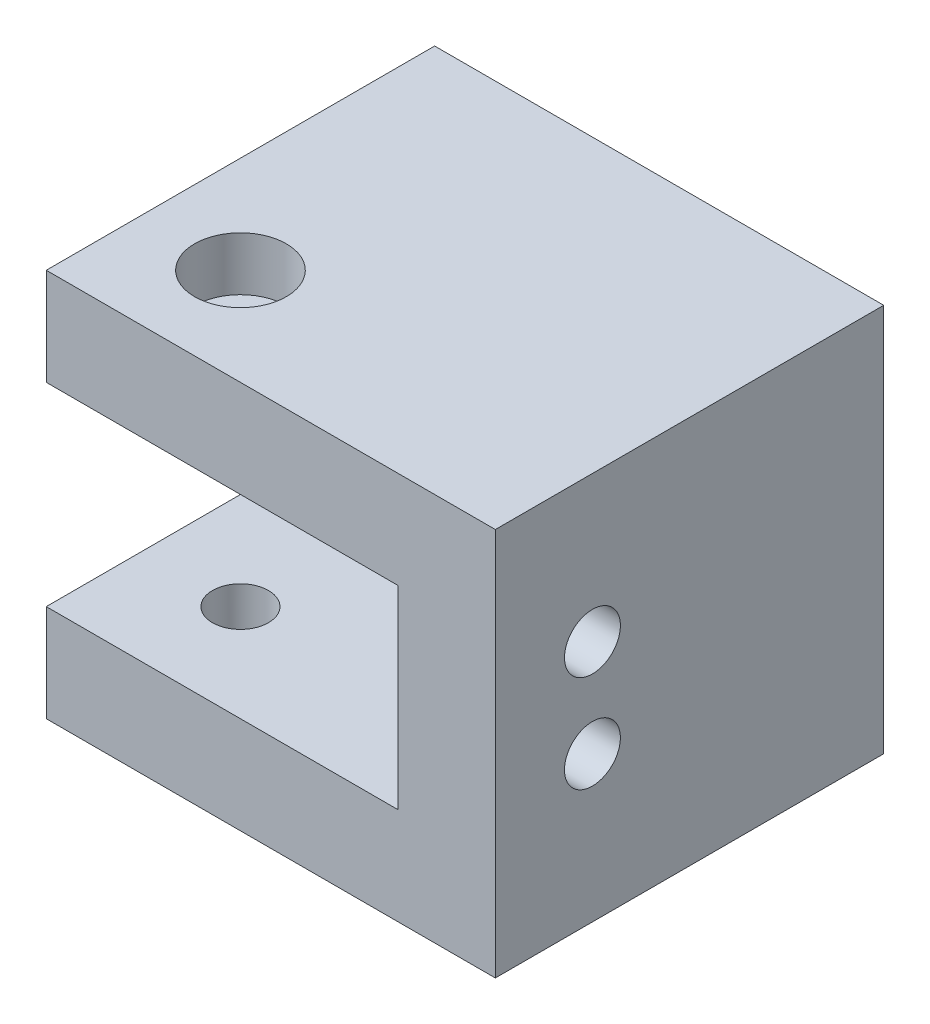
ISO-10303-21;
HEADER;
FILE_DESCRIPTION(('STEP AP214'),'2;1');
FILE_NAME('part.step','',(''),(''),'','','');
FILE_SCHEMA(('AUTOMOTIVE_DESIGN { 1 0 10303 214 1 1 1 1 }'));
ENDSEC;
DATA;
#1=APPLICATION_CONTEXT('core data for automotive mechanical design processes');
#2=APPLICATION_PROTOCOL_DEFINITION('international standard','automotive_design',2000,#1);
#3=PRODUCT_CONTEXT('',#1,'mechanical');
#4=PRODUCT('Part','Part','',(#3));
#5=PRODUCT_RELATED_PRODUCT_CATEGORY('part','',(#4));
#6=PRODUCT_DEFINITION_FORMATION('','',#4);
#7=PRODUCT_DEFINITION_CONTEXT('part definition',#1,'design');
#8=PRODUCT_DEFINITION('design','',#6,#7);
#9=PRODUCT_DEFINITION_SHAPE('','',#8);
#10=(LENGTH_UNIT() NAMED_UNIT(*) SI_UNIT(.MILLI.,.METRE.));
#11=(NAMED_UNIT(*) PLANE_ANGLE_UNIT() SI_UNIT($,.RADIAN.));
#12=(NAMED_UNIT(*) SI_UNIT($,.STERADIAN.) SOLID_ANGLE_UNIT());
#13=UNCERTAINTY_MEASURE_WITH_UNIT(LENGTH_MEASURE(1.E-05),#10,'distance_accuracy_value','');
#14=(GEOMETRIC_REPRESENTATION_CONTEXT(3) GLOBAL_UNCERTAINTY_ASSIGNED_CONTEXT((#13)) GLOBAL_UNIT_ASSIGNED_CONTEXT((#10,
#11,#12)) REPRESENTATION_CONTEXT('',''));
#15=CARTESIAN_POINT('',(0.,0.,0.));
#16=DIRECTION('',(0.,0.,1.));
#17=DIRECTION('',(1.,0.,0.));
#18=AXIS2_PLACEMENT_3D('',#15,#16,#17);
#19=CARTESIAN_POINT('',(0.,0.,25.4));
#20=DIRECTION('',(1.,0.,0.));
#21=DIRECTION('',(0.,1.,0.));
#22=AXIS2_PLACEMENT_3D('',#19,#20,#21);
#23=PLANE('',#22);
#24=DIRECTION('',(0.,-1.,0.));
#25=VECTOR('',#24,1.);
#26=CARTESIAN_POINT('',(0.,19.05,9.525));
#27=LINE('',#26,#25);
#28=CARTESIAN_POINT('',(0.,15.875,9.525));
#29=VERTEX_POINT('',#28);
#30=CARTESIAN_POINT('',(0.,9.525,9.525));
#31=VERTEX_POINT('',#30);
#32=EDGE_CURVE('E185',#29,#31,#27,.T.);
#33=ORIENTED_EDGE('',*,*,#32,.F.);
#34=CARTESIAN_POINT('',(0.,15.875,12.7));
#35=DIRECTION('',(1.,0.,0.));
#36=DIRECTION('',(0.,1.,0.));
#37=AXIS2_PLACEMENT_3D('',#34,#35,#36);
#38=CIRCLE('',#37,3.175);
#39=CARTESIAN_POINT('',(0.,19.05,12.7));
#40=VERTEX_POINT('',#39);
#41=EDGE_CURVE('E12',#29,#40,#38,.T.);
#42=ORIENTED_EDGE('',*,*,#41,.T.);
#43=DIRECTION('',(0.,0.,1.));
#44=VECTOR('',#43,1.);
#45=CARTESIAN_POINT('',(0.,19.05,9.525));
#46=LINE('',#45,#44);
#47=CARTESIAN_POINT('',(0.,19.05,25.4));
#48=VERTEX_POINT('',#47);
#49=EDGE_CURVE('E189',#40,#48,#46,.T.);
#50=ORIENTED_EDGE('',*,*,#49,.T.);
#51=DIRECTION('',(0.,-1.,0.));
#52=VECTOR('',#51,1.);
#53=CARTESIAN_POINT('',(0.,0.,25.4));
#54=LINE('',#53,#52);
#55=CARTESIAN_POINT('',(0.,25.4,25.4));
#56=VERTEX_POINT('',#55);
#57=EDGE_CURVE('E195',#56,#48,#54,.T.);
#58=ORIENTED_EDGE('',*,*,#57,.F.);
#59=DIRECTION('',(0.,0.,-1.));
#60=VECTOR('',#59,1.);
#61=CARTESIAN_POINT('',(0.,25.4,25.4));
#62=LINE('',#61,#60);
#63=CARTESIAN_POINT('',(0.,25.4,0.));
#64=VERTEX_POINT('',#63);
#65=EDGE_CURVE('E204',#56,#64,#62,.T.);
#66=ORIENTED_EDGE('',*,*,#65,.T.);
#67=DIRECTION('',(0.,-1.,0.));
#68=VECTOR('',#67,1.);
#69=CARTESIAN_POINT('',(0.,0.,0.));
#70=LINE('',#69,#68);
#71=CARTESIAN_POINT('',(0.,0.,0.));
#72=VERTEX_POINT('',#71);
#73=EDGE_CURVE('E191',#64,#72,#70,.T.);
#74=ORIENTED_EDGE('',*,*,#73,.T.);
#75=DIRECTION('',(0.,0.,-1.));
#76=VECTOR('',#75,1.);
#77=CARTESIAN_POINT('',(0.,0.,25.4));
#78=LINE('',#77,#76);
#79=CARTESIAN_POINT('',(0.,0.,25.4));
#80=VERTEX_POINT('',#79);
#81=EDGE_CURVE('E221',#80,#72,#78,.T.);
#82=ORIENTED_EDGE('',*,*,#81,.F.);
#83=CARTESIAN_POINT('',(0.,6.35,25.4));
#84=VERTEX_POINT('',#83);
#85=EDGE_CURVE('E198',#84,#80,#54,.T.);
#86=ORIENTED_EDGE('',*,*,#85,.F.);
#87=DIRECTION('',(0.,0.,1.));
#88=VECTOR('',#87,1.);
#89=CARTESIAN_POINT('',(0.,6.35,9.525));
#90=LINE('',#89,#88);
#91=CARTESIAN_POINT('',(0.,6.35,12.7));
#92=VERTEX_POINT('',#91);
#93=EDGE_CURVE('E171',#92,#84,#90,.T.);
#94=ORIENTED_EDGE('',*,*,#93,.F.);
#95=CARTESIAN_POINT('',(0.,9.525,12.7));
#96=DIRECTION('',(1.,0.,0.));
#97=DIRECTION('',(0.,1.,0.));
#98=AXIS2_PLACEMENT_3D('',#95,#96,#97);
#99=CIRCLE('',#98,3.175);
#100=EDGE_CURVE('E94',#92,#31,#99,.T.);
#101=ORIENTED_EDGE('',*,*,#100,.T.);
#102=EDGE_LOOP('',(#33,#42,#50,#58,#66,#74,#82,#86,#94,#101));
#103=FACE_BOUND('',#102,.T.);
#104=ADVANCED_FACE('F86',(#103),#23,.F.);
#105=CARTESIAN_POINT('',(0.,0.,25.4));
#106=DIRECTION('',(0.,1.,0.));
#107=DIRECTION('',(0.,0.,1.));
#108=AXIS2_PLACEMENT_3D('',#105,#106,#107);
#109=PLANE('',#108);
#110=CARTESIAN_POINT('',(6.35,0.,19.05));
#111=DIRECTION('',(0.,1.,0.));
#112=DIRECTION('',(0.,0.,1.));
#113=AXIS2_PLACEMENT_3D('',#110,#111,#112);
#114=CIRCLE('',#113,1.82879999999999);
#115=CARTESIAN_POINT('',(6.35,0.,20.8788));
#116=VERTEX_POINT('',#115);
#117=EDGE_CURVE('E228',#116,#116,#114,.T.);
#118=ORIENTED_EDGE('',*,*,#117,.T.);
#119=EDGE_LOOP('',(#118));
#120=FACE_BOUND('',#119,.T.);
#121=DIRECTION('',(1.,0.,0.));
#122=VECTOR('',#121,1.);
#123=CARTESIAN_POINT('',(0.,0.,0.));
#124=LINE('',#123,#122);
#125=CARTESIAN_POINT('',(29.36875,0.,0.));
#126=VERTEX_POINT('',#125);
#127=EDGE_CURVE('E207',#72,#126,#124,.T.);
#128=ORIENTED_EDGE('',*,*,#127,.T.);
#129=DIRECTION('',(0.,0.,-1.));
#130=VECTOR('',#129,1.);
#131=CARTESIAN_POINT('',(29.36875,0.,25.4));
#132=LINE('',#131,#130);
#133=CARTESIAN_POINT('',(29.36875,0.,25.4));
#134=VERTEX_POINT('',#133);
#135=EDGE_CURVE('E218',#134,#126,#132,.T.);
#136=ORIENTED_EDGE('',*,*,#135,.F.);
#137=DIRECTION('',(1.,0.,0.));
#138=VECTOR('',#137,1.);
#139=CARTESIAN_POINT('',(0.,0.,25.4));
#140=LINE('',#139,#138);
#141=EDGE_CURVE('E197',#80,#134,#140,.T.);
#142=ORIENTED_EDGE('',*,*,#141,.F.);
#143=ORIENTED_EDGE('',*,*,#81,.T.);
#144=EDGE_LOOP('',(#128,#136,#142,#143));
#145=FACE_BOUND('',#144,.T.);
#146=ADVANCED_FACE('F271',(#120,#145),#109,.F.);
#147=CARTESIAN_POINT('',(29.36875,0.,25.4));
#148=DIRECTION('',(-1.,0.,0.));
#149=DIRECTION('',(0.,-1.,0.));
#150=AXIS2_PLACEMENT_3D('',#147,#148,#149);
#151=PLANE('',#150);
#152=CARTESIAN_POINT('',(29.36875,15.875,19.05));
#153=DIRECTION('',(1.,0.,0.));
#154=DIRECTION('',(0.,0.,-1.));
#155=AXIS2_PLACEMENT_3D('',#152,#153,#154);
#156=CIRCLE('',#155,1.8288);
#157=CARTESIAN_POINT('',(29.36875,15.875,17.2212));
#158=VERTEX_POINT('',#157);
#159=EDGE_CURVE('E237',#158,#158,#156,.T.);
#160=ORIENTED_EDGE('',*,*,#159,.F.);
#161=EDGE_LOOP('',(#160));
#162=FACE_BOUND('',#161,.T.);
#163=CARTESIAN_POINT('',(29.36875,9.525,19.05));
#164=DIRECTION('',(1.,0.,0.));
#165=DIRECTION('',(0.,0.,-1.));
#166=AXIS2_PLACEMENT_3D('',#163,#164,#165);
#167=CIRCLE('',#166,1.8288);
#168=CARTESIAN_POINT('',(29.36875,9.525,17.2212));
#169=VERTEX_POINT('',#168);
#170=EDGE_CURVE('E233',#169,#169,#167,.T.);
#171=ORIENTED_EDGE('',*,*,#170,.F.);
#172=EDGE_LOOP('',(#171));
#173=FACE_BOUND('',#172,.T.);
#174=DIRECTION('',(0.,1.,0.));
#175=VECTOR('',#174,1.);
#176=CARTESIAN_POINT('',(29.36875,0.,0.));
#177=LINE('',#176,#175);
#178=CARTESIAN_POINT('',(29.36875,25.4,0.));
#179=VERTEX_POINT('',#178);
#180=EDGE_CURVE('E209',#126,#179,#177,.T.);
#181=ORIENTED_EDGE('',*,*,#180,.T.);
#182=DIRECTION('',(0.,0.,-1.));
#183=VECTOR('',#182,1.);
#184=CARTESIAN_POINT('',(29.36875,25.4,25.4));
#185=LINE('',#184,#183);
#186=CARTESIAN_POINT('',(29.36875,25.4,25.4));
#187=VERTEX_POINT('',#186);
#188=EDGE_CURVE('E215',#187,#179,#185,.T.);
#189=ORIENTED_EDGE('',*,*,#188,.F.);
#190=DIRECTION('',(0.,1.,0.));
#191=VECTOR('',#190,1.);
#192=CARTESIAN_POINT('',(29.36875,0.,25.4));
#193=LINE('',#192,#191);
#194=EDGE_CURVE('E200',#134,#187,#193,.T.);
#195=ORIENTED_EDGE('',*,*,#194,.F.);
#196=ORIENTED_EDGE('',*,*,#135,.T.);
#197=EDGE_LOOP('',(#181,#189,#195,#196));
#198=FACE_BOUND('',#197,.T.);
#199=ADVANCED_FACE('F275',(#162,#173,#198),#151,.F.);
#200=CARTESIAN_POINT('',(0.,25.4,25.4));
#201=DIRECTION('',(0.,-1.,0.));
#202=DIRECTION('',(0.,0.,-1.));
#203=AXIS2_PLACEMENT_3D('',#200,#201,#202);
#204=PLANE('',#203);
#205=CARTESIAN_POINT('',(6.35,25.4,19.05));
#206=DIRECTION('',(0.,1.,0.));
#207=DIRECTION('',(0.,0.,1.));
#208=AXIS2_PLACEMENT_3D('',#205,#206,#207);
#209=CIRCLE('',#208,2.999999969);
#210=CARTESIAN_POINT('',(6.35,25.4,22.049999969));
#211=VERTEX_POINT('',#210);
#212=EDGE_CURVE('E232',#211,#211,#209,.T.);
#213=ORIENTED_EDGE('',*,*,#212,.F.);
#214=EDGE_LOOP('',(#213));
#215=FACE_BOUND('',#214,.T.);
#216=DIRECTION('',(-1.,0.,0.));
#217=VECTOR('',#216,1.);
#218=CARTESIAN_POINT('',(0.,25.4,0.));
#219=LINE('',#218,#217);
#220=EDGE_CURVE('E211',#179,#64,#219,.T.);
#221=ORIENTED_EDGE('',*,*,#220,.T.);
#222=ORIENTED_EDGE('',*,*,#65,.F.);
#223=DIRECTION('',(-1.,0.,0.));
#224=VECTOR('',#223,1.);
#225=CARTESIAN_POINT('',(0.,25.4,25.4));
#226=LINE('',#225,#224);
#227=EDGE_CURVE('E202',#187,#56,#226,.T.);
#228=ORIENTED_EDGE('',*,*,#227,.F.);
#229=ORIENTED_EDGE('',*,*,#188,.T.);
#230=EDGE_LOOP('',(#221,#222,#228,#229));
#231=FACE_BOUND('',#230,.T.);
#232=ADVANCED_FACE('F281',(#215,#231),#204,.F.);
#233=CARTESIAN_POINT('',(0.,0.,25.4));
#234=DIRECTION('',(0.,0.,-1.));
#235=DIRECTION('',(-1.,0.,0.));
#236=AXIS2_PLACEMENT_3D('',#233,#234,#235);
#237=PLANE('',#236);
#238=ORIENTED_EDGE('',*,*,#57,.T.);
#239=DIRECTION('',(-1.,0.,0.));
#240=VECTOR('',#239,1.);
#241=CARTESIAN_POINT('',(0.,19.05,25.4));
#242=LINE('',#241,#240);
#243=CARTESIAN_POINT('',(23.01875,19.05,25.4));
#244=VERTEX_POINT('',#243);
#245=EDGE_CURVE('E183',#244,#48,#242,.T.);
#246=ORIENTED_EDGE('',*,*,#245,.F.);
#247=DIRECTION('',(0.,1.,0.));
#248=VECTOR('',#247,1.);
#249=CARTESIAN_POINT('',(23.01875,19.05,25.4));
#250=LINE('',#249,#248);
#251=CARTESIAN_POINT('',(23.01875,6.35,25.4));
#252=VERTEX_POINT('',#251);
#253=EDGE_CURVE('E167',#252,#244,#250,.T.);
#254=ORIENTED_EDGE('',*,*,#253,.F.);
#255=DIRECTION('',(1.,0.,0.));
#256=VECTOR('',#255,1.);
#257=CARTESIAN_POINT('',(0.,6.35,25.4));
#258=LINE('',#257,#256);
#259=EDGE_CURVE('E174',#84,#252,#258,.T.);
#260=ORIENTED_EDGE('',*,*,#259,.F.);
#261=ORIENTED_EDGE('',*,*,#85,.T.);
#262=ORIENTED_EDGE('',*,*,#141,.T.);
#263=ORIENTED_EDGE('',*,*,#194,.T.);
#264=ORIENTED_EDGE('',*,*,#227,.T.);
#265=EDGE_LOOP('',(#238,#246,#254,#260,#261,#262,#263,#264));
#266=FACE_BOUND('',#265,.T.);
#267=ADVANCED_FACE('F181',(#266),#237,.F.);
#268=CARTESIAN_POINT('',(0.,0.,0.));
#269=DIRECTION('',(0.,0.,-1.));
#270=DIRECTION('',(-1.,0.,0.));
#271=AXIS2_PLACEMENT_3D('',#268,#269,#270);
#272=PLANE('',#271);
#273=CARTESIAN_POINT('',(6.35,12.7,0.));
#274=DIRECTION('',(0.,0.,1.));
#275=DIRECTION('',(1.,0.,0.));
#276=AXIS2_PLACEMENT_3D('',#273,#274,#275);
#277=CIRCLE('',#276,2.5527);
#278=CARTESIAN_POINT('',(8.9027,12.7,0.));
#279=VERTEX_POINT('',#278);
#280=EDGE_CURVE('E332',#279,#279,#277,.T.);
#281=ORIENTED_EDGE('',*,*,#280,.T.);
#282=EDGE_LOOP('',(#281));
#283=FACE_BOUND('',#282,.T.);
#284=CARTESIAN_POINT('',(17.78,12.7,0.));
#285=DIRECTION('',(0.,0.,1.));
#286=DIRECTION('',(1.,0.,0.));
#287=AXIS2_PLACEMENT_3D('',#284,#285,#286);
#288=CIRCLE('',#287,2.5527);
#289=CARTESIAN_POINT('',(20.3327,12.7,0.));
#290=VERTEX_POINT('',#289);
#291=EDGE_CURVE('E342',#290,#290,#288,.T.);
#292=ORIENTED_EDGE('',*,*,#291,.T.);
#293=EDGE_LOOP('',(#292));
#294=FACE_BOUND('',#293,.T.);
#295=ORIENTED_EDGE('',*,*,#73,.F.);
#296=ORIENTED_EDGE('',*,*,#220,.F.);
#297=ORIENTED_EDGE('',*,*,#180,.F.);
#298=ORIENTED_EDGE('',*,*,#127,.F.);
#299=EDGE_LOOP('',(#295,#296,#297,#298));
#300=FACE_BOUND('',#299,.T.);
#301=ADVANCED_FACE('F286',(#283,#294,#300),#272,.T.);
#302=CARTESIAN_POINT('',(0.,19.05,9.525));
#303=DIRECTION('',(0.,1.,0.));
#304=DIRECTION('',(0.,0.,1.));
#305=AXIS2_PLACEMENT_3D('',#302,#303,#304);
#306=PLANE('',#305);
#307=CARTESIAN_POINT('',(6.35,19.05,19.05));
#308=DIRECTION('',(0.,1.,0.));
#309=DIRECTION('',(0.,0.,1.));
#310=AXIS2_PLACEMENT_3D('',#307,#308,#309);
#311=CIRCLE('',#310,1.8288);
#312=CARTESIAN_POINT('',(6.35,19.05,20.8788));
#313=VERTEX_POINT('',#312);
#314=EDGE_CURVE('E178',#313,#313,#311,.T.);
#315=ORIENTED_EDGE('',*,*,#314,.T.);
#316=EDGE_LOOP('',(#315));
#317=FACE_BOUND('',#316,.T.);
#318=ORIENTED_EDGE('',*,*,#49,.F.);
#319=DIRECTION('',(-1.,0.,0.));
#320=VECTOR('',#319,1.);
#321=CARTESIAN_POINT('',(0.,19.05,12.7));
#322=LINE('',#321,#320);
#323=CARTESIAN_POINT('',(23.01875,19.05,12.7));
#324=VERTEX_POINT('',#323);
#325=EDGE_CURVE('E247',#40,#324,#322,.F.);
#326=ORIENTED_EDGE('',*,*,#325,.T.);
#327=DIRECTION('',(0.,0.,1.));
#328=VECTOR('',#327,1.);
#329=CARTESIAN_POINT('',(23.01875,19.05,9.525));
#330=LINE('',#329,#328);
#331=EDGE_CURVE('E170',#324,#244,#330,.T.);
#332=ORIENTED_EDGE('',*,*,#331,.T.);
#333=ORIENTED_EDGE('',*,*,#245,.T.);
#334=EDGE_LOOP('',(#318,#326,#332,#333));
#335=FACE_BOUND('',#334,.T.);
#336=ADVANCED_FACE('F289',(#317,#335),#306,.F.);
#337=CARTESIAN_POINT('',(23.01875,19.05,9.525));
#338=DIRECTION('',(1.,0.,0.));
#339=DIRECTION('',(0.,1.,0.));
#340=AXIS2_PLACEMENT_3D('',#337,#338,#339);
#341=PLANE('',#340);
#342=CARTESIAN_POINT('',(23.01875,15.875,19.05));
#343=DIRECTION('',(1.,0.,0.));
#344=DIRECTION('',(0.,1.,0.));
#345=AXIS2_PLACEMENT_3D('',#342,#343,#344);
#346=CIRCLE('',#345,1.82879999999999);
#347=CARTESIAN_POINT('',(23.01875,17.7038,19.05));
#348=VERTEX_POINT('',#347);
#349=EDGE_CURVE('E234',#348,#348,#346,.T.);
#350=ORIENTED_EDGE('',*,*,#349,.T.);
#351=EDGE_LOOP('',(#350));
#352=FACE_BOUND('',#351,.T.);
#353=CARTESIAN_POINT('',(23.01875,9.525,19.05));
#354=DIRECTION('',(1.,0.,0.));
#355=DIRECTION('',(0.,1.,0.));
#356=AXIS2_PLACEMENT_3D('',#353,#354,#355);
#357=CIRCLE('',#356,1.8288);
#358=CARTESIAN_POINT('',(23.01875,11.3538,19.05));
#359=VERTEX_POINT('',#358);
#360=EDGE_CURVE('E229',#359,#359,#357,.T.);
#361=ORIENTED_EDGE('',*,*,#360,.T.);
#362=EDGE_LOOP('',(#361));
#363=FACE_BOUND('',#362,.T.);
#364=DIRECTION('',(0.,1.,0.));
#365=VECTOR('',#364,1.);
#366=CARTESIAN_POINT('',(23.01875,19.05,9.525));
#367=LINE('',#366,#365);
#368=CARTESIAN_POINT('',(23.01875,9.525,9.525));
#369=VERTEX_POINT('',#368);
#370=CARTESIAN_POINT('',(23.01875,15.875,9.525));
#371=VERTEX_POINT('',#370);
#372=EDGE_CURVE('E194',#369,#371,#367,.T.);
#373=ORIENTED_EDGE('',*,*,#372,.F.);
#374=CARTESIAN_POINT('',(23.01875,9.525,12.7));
#375=DIRECTION('',(1.,0.,0.));
#376=DIRECTION('',(0.,1.,0.));
#377=AXIS2_PLACEMENT_3D('',#374,#375,#376);
#378=CIRCLE('',#377,3.175);
#379=CARTESIAN_POINT('',(23.01875,6.35,12.7));
#380=VERTEX_POINT('',#379);
#381=EDGE_CURVE('E169',#369,#380,#378,.F.);
#382=ORIENTED_EDGE('',*,*,#381,.T.);
#383=DIRECTION('',(0.,0.,1.));
#384=VECTOR('',#383,1.);
#385=CARTESIAN_POINT('',(23.01875,6.35,9.525));
#386=LINE('',#385,#384);
#387=EDGE_CURVE('E161',#380,#252,#386,.T.);
#388=ORIENTED_EDGE('',*,*,#387,.T.);
#389=ORIENTED_EDGE('',*,*,#253,.T.);
#390=ORIENTED_EDGE('',*,*,#331,.F.);
#391=CARTESIAN_POINT('',(23.01875,15.875,12.7));
#392=DIRECTION('',(1.,0.,0.));
#393=DIRECTION('',(0.,1.,0.));
#394=AXIS2_PLACEMENT_3D('',#391,#392,#393);
#395=CIRCLE('',#394,3.175);
#396=EDGE_CURVE('E243',#324,#371,#395,.F.);
#397=ORIENTED_EDGE('',*,*,#396,.T.);
#398=EDGE_LOOP('',(#373,#382,#388,#389,#390,#397));
#399=FACE_BOUND('',#398,.T.);
#400=ADVANCED_FACE('F164',(#352,#363,#399),#341,.F.);
#401=CARTESIAN_POINT('',(0.,6.35,9.525));
#402=DIRECTION('',(0.,-1.,0.));
#403=DIRECTION('',(0.,0.,-1.));
#404=AXIS2_PLACEMENT_3D('',#401,#402,#403);
#405=PLANE('',#404);
#406=CARTESIAN_POINT('',(6.35,6.35,19.05));
#407=DIRECTION('',(0.,-1.,0.));
#408=DIRECTION('',(0.,0.,-1.));
#409=AXIS2_PLACEMENT_3D('',#406,#407,#408);
#410=CIRCLE('',#409,1.8288);
#411=CARTESIAN_POINT('',(6.35,6.35,17.2212));
#412=VERTEX_POINT('',#411);
#413=EDGE_CURVE('E225',#412,#412,#410,.T.);
#414=ORIENTED_EDGE('',*,*,#413,.T.);
#415=EDGE_LOOP('',(#414));
#416=FACE_BOUND('',#415,.T.);
#417=ORIENTED_EDGE('',*,*,#387,.F.);
#418=DIRECTION('',(1.,0.,0.));
#419=VECTOR('',#418,1.);
#420=CARTESIAN_POINT('',(0.,6.35,12.7));
#421=LINE('',#420,#419);
#422=EDGE_CURVE('E107',#380,#92,#421,.F.);
#423=ORIENTED_EDGE('',*,*,#422,.T.);
#424=ORIENTED_EDGE('',*,*,#93,.T.);
#425=ORIENTED_EDGE('',*,*,#259,.T.);
#426=EDGE_LOOP('',(#417,#423,#424,#425));
#427=FACE_BOUND('',#426,.T.);
#428=ADVANCED_FACE('F175',(#416,#427),#405,.F.);
#429=CARTESIAN_POINT('',(0.,0.,9.525));
#430=DIRECTION('',(0.,0.,1.));
#431=DIRECTION('',(1.,0.,0.));
#432=AXIS2_PLACEMENT_3D('',#429,#430,#431);
#433=PLANE('',#432);
#434=CARTESIAN_POINT('',(6.35,12.7,9.525));
#435=DIRECTION('',(0.,0.,1.));
#436=DIRECTION('',(1.,0.,0.));
#437=AXIS2_PLACEMENT_3D('',#434,#435,#436);
#438=CIRCLE('',#437,2.5527);
#439=CARTESIAN_POINT('',(8.9027,12.7,9.525));
#440=VERTEX_POINT('',#439);
#441=EDGE_CURVE('E335',#440,#440,#438,.T.);
#442=ORIENTED_EDGE('',*,*,#441,.F.);
#443=EDGE_LOOP('',(#442));
#444=FACE_BOUND('',#443,.T.);
#445=CARTESIAN_POINT('',(17.78,12.7,9.525));
#446=DIRECTION('',(0.,0.,1.));
#447=DIRECTION('',(1.,0.,0.));
#448=AXIS2_PLACEMENT_3D('',#445,#446,#447);
#449=CIRCLE('',#448,2.5527);
#450=CARTESIAN_POINT('',(20.3327,12.7,9.525));
#451=VERTEX_POINT('',#450);
#452=EDGE_CURVE('E337',#451,#451,#449,.T.);
#453=ORIENTED_EDGE('',*,*,#452,.F.);
#454=EDGE_LOOP('',(#453));
#455=FACE_BOUND('',#454,.T.);
#456=ORIENTED_EDGE('',*,*,#32,.T.);
#457=DIRECTION('',(1.,0.,0.));
#458=VECTOR('',#457,1.);
#459=CARTESIAN_POINT('',(0.,9.525,9.525));
#460=LINE('',#459,#458);
#461=EDGE_CURVE('E240',#31,#369,#460,.T.);
#462=ORIENTED_EDGE('',*,*,#461,.T.);
#463=ORIENTED_EDGE('',*,*,#372,.T.);
#464=DIRECTION('',(-1.,0.,0.));
#465=VECTOR('',#464,1.);
#466=CARTESIAN_POINT('',(0.,15.875,9.525));
#467=LINE('',#466,#465);
#468=EDGE_CURVE('E224',#371,#29,#467,.T.);
#469=ORIENTED_EDGE('',*,*,#468,.T.);
#470=EDGE_LOOP('',(#456,#462,#463,#469));
#471=FACE_BOUND('',#470,.T.);
#472=ADVANCED_FACE('F253',(#444,#455,#471),#433,.T.);
#473=CARTESIAN_POINT('',(6.35,25.4,19.05));
#474=DIRECTION('',(0.,1.,0.));
#475=DIRECTION('',(0.,0.,1.));
#476=AXIS2_PLACEMENT_3D('',#473,#474,#475);
#477=CYLINDRICAL_SURFACE('',#476,1.8288);
#478=ORIENTED_EDGE('',*,*,#117,.F.);
#479=EDGE_LOOP('',(#478));
#480=FACE_BOUND('',#479,.T.);
#481=ORIENTED_EDGE('',*,*,#413,.F.);
#482=EDGE_LOOP('',(#481));
#483=FACE_BOUND('',#482,.T.);
#484=ADVANCED_FACE('F304',(#480,#483),#477,.F.);
#485=CARTESIAN_POINT('',(6.35,21.8948,19.05));
#486=DIRECTION('',(0.,1.,0.));
#487=DIRECTION('',(0.,0.,1.));
#488=AXIS2_PLACEMENT_3D('',#485,#486,#487);
#489=CIRCLE('',#488,1.8288);
#490=CARTESIAN_POINT('',(6.35,21.8948,20.8788));
#491=VERTEX_POINT('',#490);
#492=EDGE_CURVE('E354',#491,#491,#489,.T.);
#493=ORIENTED_EDGE('',*,*,#492,.T.);
#494=EDGE_LOOP('',(#493));
#495=FACE_BOUND('',#494,.T.);
#496=ORIENTED_EDGE('',*,*,#314,.F.);
#497=EDGE_LOOP('',(#496));
#498=FACE_BOUND('',#497,.T.);
#499=ADVANCED_FACE('F306',(#495,#498),#477,.F.);
#500=CARTESIAN_POINT('',(8.1788,21.8948,19.05));
#501=DIRECTION('',(0.,-1.,0.));
#502=DIRECTION('',(0.,0.,-1.));
#503=AXIS2_PLACEMENT_3D('',#500,#501,#502);
#504=PLANE('',#503);
#505=ORIENTED_EDGE('',*,*,#492,.F.);
#506=EDGE_LOOP('',(#505));
#507=FACE_BOUND('',#506,.T.);
#508=CARTESIAN_POINT('',(6.35,21.8948,19.05));
#509=DIRECTION('',(0.,1.,0.));
#510=DIRECTION('',(0.,0.,1.));
#511=AXIS2_PLACEMENT_3D('',#508,#509,#510);
#512=CIRCLE('',#511,2.999999969);
#513=CARTESIAN_POINT('',(6.35,21.8948,22.049999969));
#514=VERTEX_POINT('',#513);
#515=EDGE_CURVE('E351',#514,#514,#512,.T.);
#516=ORIENTED_EDGE('',*,*,#515,.T.);
#517=EDGE_LOOP('',(#516));
#518=FACE_BOUND('',#517,.T.);
#519=ADVANCED_FACE('F309',(#507,#518),#504,.F.);
#520=CARTESIAN_POINT('',(6.35,25.4,19.05));
#521=DIRECTION('',(0.,1.,0.));
#522=DIRECTION('',(0.,0.,1.));
#523=AXIS2_PLACEMENT_3D('',#520,#521,#522);
#524=CYLINDRICAL_SURFACE('',#523,2.999999969);
#525=ORIENTED_EDGE('',*,*,#515,.F.);
#526=EDGE_LOOP('',(#525));
#527=FACE_BOUND('',#526,.T.);
#528=ORIENTED_EDGE('',*,*,#212,.T.);
#529=EDGE_LOOP('',(#528));
#530=FACE_BOUND('',#529,.T.);
#531=ADVANCED_FACE('F313',(#527,#530),#524,.F.);
#532=CARTESIAN_POINT('',(29.36875,9.525,19.05));
#533=DIRECTION('',(1.,0.,0.));
#534=DIRECTION('',(0.,0.,-1.));
#535=AXIS2_PLACEMENT_3D('',#532,#533,#534);
#536=CYLINDRICAL_SURFACE('',#535,1.8288);
#537=ORIENTED_EDGE('',*,*,#170,.T.);
#538=EDGE_LOOP('',(#537));
#539=FACE_BOUND('',#538,.T.);
#540=ORIENTED_EDGE('',*,*,#360,.F.);
#541=EDGE_LOOP('',(#540));
#542=FACE_BOUND('',#541,.T.);
#543=ADVANCED_FACE('F266',(#539,#542),#536,.F.);
#544=CARTESIAN_POINT('',(29.36875,15.875,19.05));
#545=DIRECTION('',(1.,0.,0.));
#546=DIRECTION('',(0.,0.,-1.));
#547=AXIS2_PLACEMENT_3D('',#544,#545,#546);
#548=CYLINDRICAL_SURFACE('',#547,1.82879999999999);
#549=ORIENTED_EDGE('',*,*,#159,.T.);
#550=EDGE_LOOP('',(#549));
#551=FACE_BOUND('',#550,.T.);
#552=ORIENTED_EDGE('',*,*,#349,.F.);
#553=EDGE_LOOP('',(#552));
#554=FACE_BOUND('',#553,.T.);
#555=ADVANCED_FACE('F259',(#551,#554),#548,.F.);
#556=CARTESIAN_POINT('',(0.,9.525,12.7));
#557=DIRECTION('',(1.,0.,0.));
#558=DIRECTION('',(0.,0.,-1.));
#559=AXIS2_PLACEMENT_3D('',#556,#557,#558);
#560=CYLINDRICAL_SURFACE('',#559,3.175);
#561=ORIENTED_EDGE('',*,*,#100,.F.);
#562=ORIENTED_EDGE('',*,*,#422,.F.);
#563=ORIENTED_EDGE('',*,*,#381,.F.);
#564=ORIENTED_EDGE('',*,*,#461,.F.);
#565=EDGE_LOOP('',(#561,#562,#563,#564));
#566=FACE_BOUND('',#565,.T.);
#567=ADVANCED_FACE('F257',(#566),#560,.F.);
#568=CARTESIAN_POINT('',(0.,15.875,12.7));
#569=DIRECTION('',(-1.,0.,0.));
#570=DIRECTION('',(0.,0.,1.));
#571=AXIS2_PLACEMENT_3D('',#568,#569,#570);
#572=CYLINDRICAL_SURFACE('',#571,3.175);
#573=ORIENTED_EDGE('',*,*,#396,.F.);
#574=ORIENTED_EDGE('',*,*,#325,.F.);
#575=ORIENTED_EDGE('',*,*,#41,.F.);
#576=ORIENTED_EDGE('',*,*,#468,.F.);
#577=EDGE_LOOP('',(#573,#574,#575,#576));
#578=FACE_BOUND('',#577,.T.);
#579=ADVANCED_FACE('F88',(#578),#572,.F.);
#580=CARTESIAN_POINT('',(17.78,12.7,9.525));
#581=DIRECTION('',(0.,0.,1.));
#582=DIRECTION('',(1.,0.,0.));
#583=AXIS2_PLACEMENT_3D('',#580,#581,#582);
#584=CYLINDRICAL_SURFACE('',#583,2.5527);
#585=ORIENTED_EDGE('',*,*,#291,.F.);
#586=EDGE_LOOP('',(#585));
#587=FACE_BOUND('',#586,.T.);
#588=ORIENTED_EDGE('',*,*,#452,.T.);
#589=EDGE_LOOP('',(#588));
#590=FACE_BOUND('',#589,.T.);
#591=ADVANCED_FACE('F264',(#587,#590),#584,.F.);
#592=CARTESIAN_POINT('',(6.35,12.7,9.525));
#593=DIRECTION('',(0.,0.,1.));
#594=DIRECTION('',(1.,0.,0.));
#595=AXIS2_PLACEMENT_3D('',#592,#593,#594);
#596=CYLINDRICAL_SURFACE('',#595,2.5527);
#597=ORIENTED_EDGE('',*,*,#280,.F.);
#598=EDGE_LOOP('',(#597));
#599=FACE_BOUND('',#598,.T.);
#600=ORIENTED_EDGE('',*,*,#441,.T.);
#601=EDGE_LOOP('',(#600));
#602=FACE_BOUND('',#601,.T.);
#603=ADVANCED_FACE('F323',(#599,#602),#596,.F.);
#604=CLOSED_SHELL('',(#104,#146,#199,#232,#267,#301,#336,#400,#428,#472,#484,#499,#519,#531,
#543,#555,#567,#579,#591,#603));
#605=MANIFOLD_SOLID_BREP('B2',#604);
#606=ADVANCED_BREP_SHAPE_REPRESENTATION('',(#18,#605),#14);
#607=SHAPE_DEFINITION_REPRESENTATION(#9,#606);
ENDSEC;
END-ISO-10303-21;
